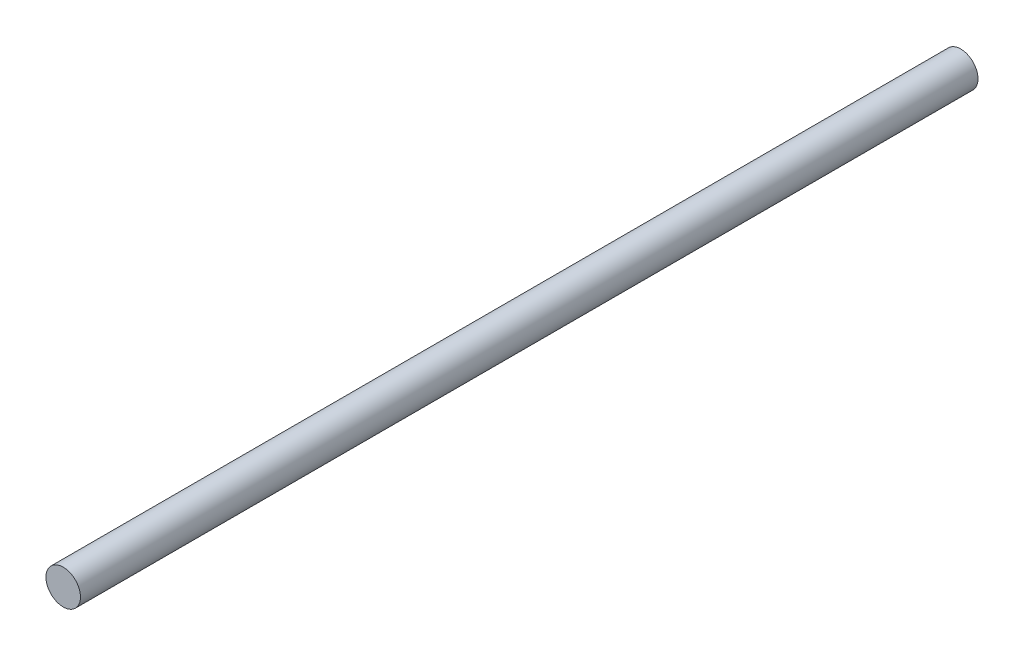
ISO-10303-21;
HEADER;
FILE_DESCRIPTION(('STEP AP214'),'2;1');
FILE_NAME('part.step','',(''),(''),'','','');
FILE_SCHEMA(('AUTOMOTIVE_DESIGN { 1 0 10303 214 1 1 1 1 }'));
ENDSEC;
DATA;
#1=APPLICATION_CONTEXT('core data for automotive mechanical design processes');
#2=APPLICATION_PROTOCOL_DEFINITION('international standard','automotive_design',2000,#1);
#3=PRODUCT_CONTEXT('',#1,'mechanical');
#4=PRODUCT('Part','Part','',(#3));
#5=PRODUCT_RELATED_PRODUCT_CATEGORY('part','',(#4));
#6=PRODUCT_DEFINITION_FORMATION('','',#4);
#7=PRODUCT_DEFINITION_CONTEXT('part definition',#1,'design');
#8=PRODUCT_DEFINITION('design','',#6,#7);
#9=PRODUCT_DEFINITION_SHAPE('','',#8);
#10=(LENGTH_UNIT() NAMED_UNIT(*) SI_UNIT(.MILLI.,.METRE.));
#11=(NAMED_UNIT(*) PLANE_ANGLE_UNIT() SI_UNIT($,.RADIAN.));
#12=(NAMED_UNIT(*) SI_UNIT($,.STERADIAN.) SOLID_ANGLE_UNIT());
#13=UNCERTAINTY_MEASURE_WITH_UNIT(LENGTH_MEASURE(1.E-05),#10,'distance_accuracy_value','');
#14=(GEOMETRIC_REPRESENTATION_CONTEXT(3) GLOBAL_UNCERTAINTY_ASSIGNED_CONTEXT((#13)) GLOBAL_UNIT_ASSIGNED_CONTEXT((#10,
#11,#12)) REPRESENTATION_CONTEXT('',''));
#15=CARTESIAN_POINT('',(0.,0.,0.));
#16=DIRECTION('',(0.,0.,1.));
#17=DIRECTION('',(1.,0.,0.));
#18=AXIS2_PLACEMENT_3D('',#15,#16,#17);
#19=CARTESIAN_POINT('',(0.,0.,330.2));
#20=DIRECTION('',(0.,0.,-1.));
#21=DIRECTION('',(-1.,0.,0.));
#22=AXIS2_PLACEMENT_3D('',#19,#20,#21);
#23=CYLINDRICAL_SURFACE('',#22,6.35);
#24=CARTESIAN_POINT('',(0.,0.,330.2));
#25=DIRECTION('',(0.,0.,1.));
#26=DIRECTION('',(1.,0.,0.));
#27=AXIS2_PLACEMENT_3D('',#24,#25,#26);
#28=CIRCLE('',#27,6.35);
#29=CARTESIAN_POINT('',(6.35,0.,330.2));
#30=VERTEX_POINT('',#29);
#31=EDGE_CURVE('E10',#30,#30,#28,.T.);
#32=ORIENTED_EDGE('',*,*,#31,.F.);
#33=EDGE_LOOP('',(#32));
#34=FACE_BOUND('',#33,.T.);
#35=CARTESIAN_POINT('',(0.,0.,0.));
#36=DIRECTION('',(0.,0.,1.));
#37=DIRECTION('',(1.,0.,0.));
#38=AXIS2_PLACEMENT_3D('',#35,#36,#37);
#39=CIRCLE('',#38,6.35);
#40=CARTESIAN_POINT('',(6.35,0.,0.));
#41=VERTEX_POINT('',#40);
#42=EDGE_CURVE('E36',#41,#41,#39,.T.);
#43=ORIENTED_EDGE('',*,*,#42,.T.);
#44=EDGE_LOOP('',(#43));
#45=FACE_BOUND('',#44,.T.);
#46=ADVANCED_FACE('F33',(#34,#45),#23,.T.);
#47=CARTESIAN_POINT('',(0.,0.,330.2));
#48=DIRECTION('',(0.,0.,1.));
#49=DIRECTION('',(1.,0.,0.));
#50=AXIS2_PLACEMENT_3D('',#47,#48,#49);
#51=PLANE('',#50);
#52=ORIENTED_EDGE('',*,*,#31,.T.);
#53=EDGE_LOOP('',(#52));
#54=FACE_BOUND('',#53,.T.);
#55=ADVANCED_FACE('F48',(#54),#51,.T.);
#56=CARTESIAN_POINT('',(0.,0.,0.));
#57=DIRECTION('',(0.,0.,1.));
#58=DIRECTION('',(1.,0.,0.));
#59=AXIS2_PLACEMENT_3D('',#56,#57,#58);
#60=PLANE('',#59);
#61=ORIENTED_EDGE('',*,*,#42,.F.);
#62=EDGE_LOOP('',(#61));
#63=FACE_BOUND('',#62,.T.);
#64=ADVANCED_FACE('F46',(#63),#60,.F.);
#65=CLOSED_SHELL('',(#46,#55,#64));
#66=MANIFOLD_SOLID_BREP('B2',#65);
#67=ADVANCED_BREP_SHAPE_REPRESENTATION('',(#18,#66),#14);
#68=SHAPE_DEFINITION_REPRESENTATION(#9,#67);
ENDSEC;
END-ISO-10303-21;
